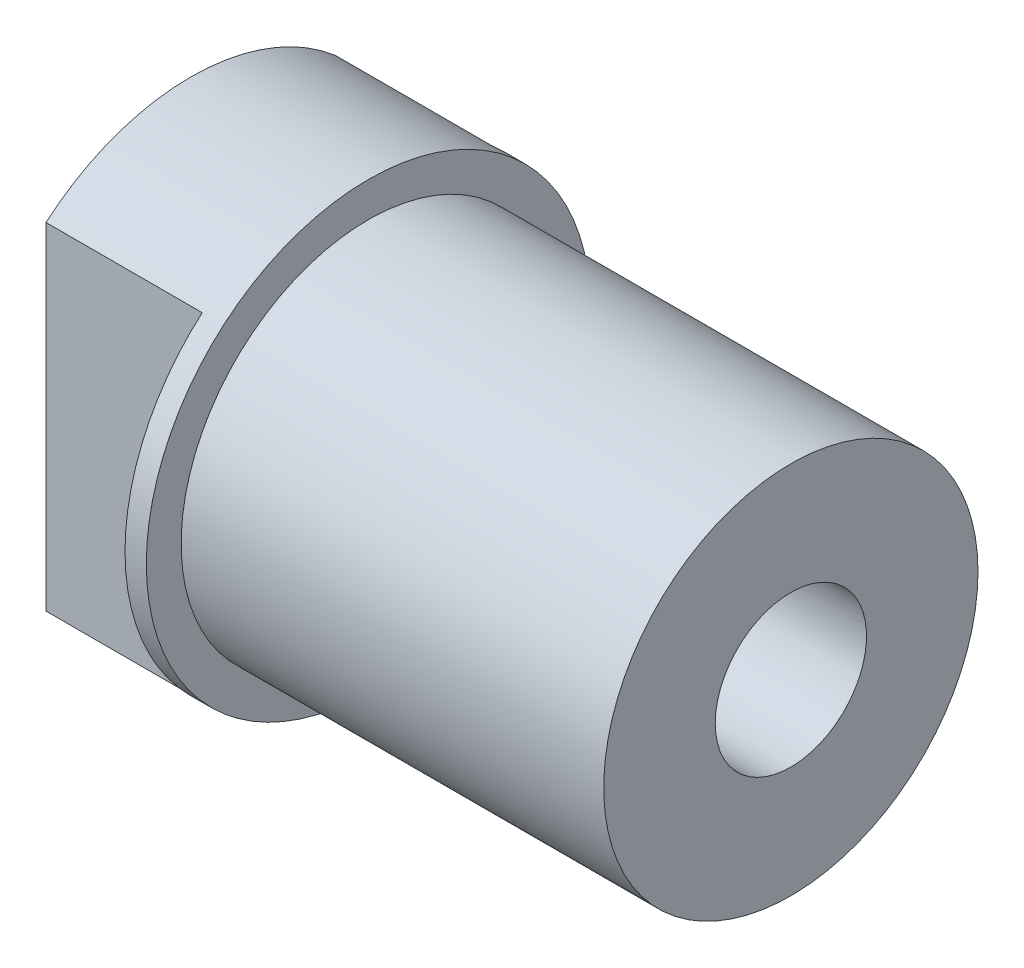
ISO-10303-21;
HEADER;
FILE_DESCRIPTION(('STEP AP214'),'2;1');
FILE_NAME('part.step','',(''),(''),'','','');
FILE_SCHEMA(('AUTOMOTIVE_DESIGN { 1 0 10303 214 1 1 1 1 }'));
ENDSEC;
DATA;
#1=APPLICATION_CONTEXT('core data for automotive mechanical design processes');
#2=APPLICATION_PROTOCOL_DEFINITION('international standard','automotive_design',2000,#1);
#3=PRODUCT_CONTEXT('',#1,'mechanical');
#4=PRODUCT('Part','Part','',(#3));
#5=PRODUCT_RELATED_PRODUCT_CATEGORY('part','',(#4));
#6=PRODUCT_DEFINITION_FORMATION('','',#4);
#7=PRODUCT_DEFINITION_CONTEXT('part definition',#1,'design');
#8=PRODUCT_DEFINITION('design','',#6,#7);
#9=PRODUCT_DEFINITION_SHAPE('','',#8);
#10=(LENGTH_UNIT() NAMED_UNIT(*) SI_UNIT(.MILLI.,.METRE.));
#11=(NAMED_UNIT(*) PLANE_ANGLE_UNIT() SI_UNIT($,.RADIAN.));
#12=(NAMED_UNIT(*) SI_UNIT($,.STERADIAN.) SOLID_ANGLE_UNIT());
#13=UNCERTAINTY_MEASURE_WITH_UNIT(LENGTH_MEASURE(1.E-05),#10,'distance_accuracy_value','');
#14=(GEOMETRIC_REPRESENTATION_CONTEXT(3) GLOBAL_UNCERTAINTY_ASSIGNED_CONTEXT((#13)) GLOBAL_UNIT_ASSIGNED_CONTEXT((#10,
#11,#12)) REPRESENTATION_CONTEXT('',''));
#15=CARTESIAN_POINT('',(0.,0.,0.));
#16=DIRECTION('',(0.,0.,1.));
#17=DIRECTION('',(1.,0.,0.));
#18=AXIS2_PLACEMENT_3D('',#15,#16,#17);
#19=CARTESIAN_POINT('',(-6.35,0.,0.));
#20=DIRECTION('',(1.,0.,0.));
#21=DIRECTION('',(0.,0.,-1.));
#22=AXIS2_PLACEMENT_3D('',#19,#20,#21);
#23=CYLINDRICAL_SURFACE('',#22,7.9375);
#24=DIRECTION('',(1.,0.,0.));
#25=VECTOR('',#24,1.);
#26=CARTESIAN_POINT('',(-6.35,-6.01836304052024,-5.17525));
#27=LINE('',#26,#25);
#28=CARTESIAN_POINT('',(-0.762,-6.01836304052024,-5.17525));
#29=VERTEX_POINT('',#28);
#30=CARTESIAN_POINT('',(-6.35,-6.01836304052024,-5.17525));
#31=VERTEX_POINT('',#30);
#32=EDGE_CURVE('E52',#29,#31,#27,.F.);
#33=ORIENTED_EDGE('',*,*,#32,.F.);
#34=CARTESIAN_POINT('',(-0.762,0.,0.));
#35=DIRECTION('',(1.,0.,0.));
#36=DIRECTION('',(0.,0.,-1.));
#37=AXIS2_PLACEMENT_3D('',#34,#35,#36);
#38=CIRCLE('',#37,7.9375);
#39=CARTESIAN_POINT('',(-0.762,6.01836304052024,-5.17525));
#40=VERTEX_POINT('',#39);
#41=EDGE_CURVE('E11',#40,#29,#38,.F.);
#42=ORIENTED_EDGE('',*,*,#41,.F.);
#43=DIRECTION('',(1.,0.,0.));
#44=VECTOR('',#43,1.);
#45=CARTESIAN_POINT('',(-6.35,6.01836304052024,-5.17525));
#46=LINE('',#45,#44);
#47=CARTESIAN_POINT('',(-6.35,6.01836304052024,-5.17525));
#48=VERTEX_POINT('',#47);
#49=EDGE_CURVE('E102',#48,#40,#46,.T.);
#50=ORIENTED_EDGE('',*,*,#49,.F.);
#51=CARTESIAN_POINT('',(-6.35,0.,0.));
#52=DIRECTION('',(1.,0.,0.));
#53=DIRECTION('',(0.,0.,-1.));
#54=AXIS2_PLACEMENT_3D('',#51,#52,#53);
#55=CIRCLE('',#54,7.9375);
#56=CARTESIAN_POINT('',(-6.35,6.01836304052024,5.17525));
#57=VERTEX_POINT('',#56);
#58=EDGE_CURVE('E112',#48,#57,#55,.T.);
#59=ORIENTED_EDGE('',*,*,#58,.T.);
#60=DIRECTION('',(1.,0.,0.));
#61=VECTOR('',#60,1.);
#62=CARTESIAN_POINT('',(-6.35,6.01836304052024,5.17525));
#63=LINE('',#62,#61);
#64=CARTESIAN_POINT('',(-0.762,6.01836304052024,5.17525));
#65=VERTEX_POINT('',#64);
#66=EDGE_CURVE('E60',#65,#57,#63,.F.);
#67=ORIENTED_EDGE('',*,*,#66,.F.);
#68=CARTESIAN_POINT('',(-0.762,0.,0.));
#69=DIRECTION('',(1.,0.,0.));
#70=DIRECTION('',(0.,0.,-1.));
#71=AXIS2_PLACEMENT_3D('',#68,#69,#70);
#72=CIRCLE('',#71,7.9375);
#73=CARTESIAN_POINT('',(-0.762,-6.01836304052024,5.17525));
#74=VERTEX_POINT('',#73);
#75=EDGE_CURVE('E45',#74,#65,#72,.F.);
#76=ORIENTED_EDGE('',*,*,#75,.F.);
#77=DIRECTION('',(1.,0.,0.));
#78=VECTOR('',#77,1.);
#79=CARTESIAN_POINT('',(-6.35,-6.01836304052024,5.17525));
#80=LINE('',#79,#78);
#81=CARTESIAN_POINT('',(-6.35,-6.01836304052024,5.17525));
#82=VERTEX_POINT('',#81);
#83=EDGE_CURVE('E81',#82,#74,#80,.T.);
#84=ORIENTED_EDGE('',*,*,#83,.F.);
#85=EDGE_CURVE('E113',#82,#31,#55,.T.);
#86=ORIENTED_EDGE('',*,*,#85,.T.);
#87=EDGE_LOOP('',(#33,#42,#50,#59,#67,#76,#84,#86));
#88=FACE_BOUND('',#87,.T.);
#89=CARTESIAN_POINT('',(0.,0.,0.));
#90=DIRECTION('',(1.,0.,0.));
#91=DIRECTION('',(0.,0.,-1.));
#92=AXIS2_PLACEMENT_3D('',#89,#90,#91);
#93=CIRCLE('',#92,7.9375);
#94=CARTESIAN_POINT('',(0.,0.,-7.9375));
#95=VERTEX_POINT('',#94);
#96=EDGE_CURVE('E108',#95,#95,#93,.T.);
#97=ORIENTED_EDGE('',*,*,#96,.F.);
#98=EDGE_LOOP('',(#97));
#99=FACE_BOUND('',#98,.T.);
#100=ADVANCED_FACE('F38',(#88,#99),#23,.T.);
#101=CARTESIAN_POINT('',(-6.35,0.,0.));
#102=DIRECTION('',(1.,0.,0.));
#103=DIRECTION('',(0.,0.,-1.));
#104=AXIS2_PLACEMENT_3D('',#101,#102,#103);
#105=PLANE('',#104);
#106=CARTESIAN_POINT('',(-6.35,0.,0.));
#107=DIRECTION('',(-1.,0.,0.));
#108=DIRECTION('',(0.,0.,1.));
#109=AXIS2_PLACEMENT_3D('',#106,#107,#108);
#110=CIRCLE('',#109,2.7051);
#111=CARTESIAN_POINT('',(-6.35,0.,2.7051));
#112=VERTEX_POINT('',#111);
#113=EDGE_CURVE('E98',#112,#112,#110,.T.);
#114=ORIENTED_EDGE('',*,*,#113,.F.);
#115=EDGE_LOOP('',(#114));
#116=FACE_BOUND('',#115,.T.);
#117=ORIENTED_EDGE('',*,*,#58,.F.);
#118=DIRECTION('',(0.,-1.,0.));
#119=VECTOR('',#118,1.);
#120=CARTESIAN_POINT('',(-6.35,0.,-5.17525));
#121=LINE('',#120,#119);
#122=EDGE_CURVE('E86',#48,#31,#121,.T.);
#123=ORIENTED_EDGE('',*,*,#122,.T.);
#124=ORIENTED_EDGE('',*,*,#85,.F.);
#125=DIRECTION('',(0.,1.,0.));
#126=VECTOR('',#125,1.);
#127=CARTESIAN_POINT('',(-6.35,0.,5.17525));
#128=LINE('',#127,#126);
#129=EDGE_CURVE('E89',#82,#57,#128,.T.);
#130=ORIENTED_EDGE('',*,*,#129,.T.);
#131=EDGE_LOOP('',(#117,#123,#124,#130));
#132=FACE_BOUND('',#131,.T.);
#133=ADVANCED_FACE('F120',(#116,#132),#105,.F.);
#134=CARTESIAN_POINT('',(0.,0.,0.));
#135=DIRECTION('',(1.,0.,0.));
#136=DIRECTION('',(0.,0.,-1.));
#137=AXIS2_PLACEMENT_3D('',#134,#135,#136);
#138=PLANE('',#137);
#139=CARTESIAN_POINT('',(0.,0.,0.));
#140=DIRECTION('',(1.,0.,0.));
#141=DIRECTION('',(0.,0.,-1.));
#142=AXIS2_PLACEMENT_3D('',#139,#140,#141);
#143=CIRCLE('',#142,6.6929);
#144=CARTESIAN_POINT('',(0.,0.,-6.6929));
#145=VERTEX_POINT('',#144);
#146=EDGE_CURVE('E109',#145,#145,#143,.T.);
#147=ORIENTED_EDGE('',*,*,#146,.F.);
#148=EDGE_LOOP('',(#147));
#149=FACE_BOUND('',#148,.T.);
#150=ORIENTED_EDGE('',*,*,#96,.T.);
#151=EDGE_LOOP('',(#150));
#152=FACE_BOUND('',#151,.T.);
#153=ADVANCED_FACE('F141',(#149,#152),#138,.T.);
#154=CARTESIAN_POINT('',(15.113,0.,0.));
#155=DIRECTION('',(-1.,0.,0.));
#156=DIRECTION('',(0.,0.,1.));
#157=AXIS2_PLACEMENT_3D('',#154,#155,#156);
#158=CYLINDRICAL_SURFACE('',#157,6.6929);
#159=CARTESIAN_POINT('',(15.113,0.,0.));
#160=DIRECTION('',(1.,0.,0.));
#161=DIRECTION('',(0.,0.,-1.));
#162=AXIS2_PLACEMENT_3D('',#159,#160,#161);
#163=CIRCLE('',#162,6.6929);
#164=CARTESIAN_POINT('',(15.113,0.,-6.6929));
#165=VERTEX_POINT('',#164);
#166=EDGE_CURVE('E105',#165,#165,#163,.T.);
#167=ORIENTED_EDGE('',*,*,#166,.F.);
#168=EDGE_LOOP('',(#167));
#169=FACE_BOUND('',#168,.T.);
#170=ORIENTED_EDGE('',*,*,#146,.T.);
#171=EDGE_LOOP('',(#170));
#172=FACE_BOUND('',#171,.T.);
#173=ADVANCED_FACE('F147',(#169,#172),#158,.T.);
#174=CARTESIAN_POINT('',(15.113,0.,0.));
#175=DIRECTION('',(1.,0.,0.));
#176=DIRECTION('',(0.,0.,-1.));
#177=AXIS2_PLACEMENT_3D('',#174,#175,#176);
#178=PLANE('',#177);
#179=CARTESIAN_POINT('',(15.113,0.,0.));
#180=DIRECTION('',(-1.,0.,0.));
#181=DIRECTION('',(0.,0.,1.));
#182=AXIS2_PLACEMENT_3D('',#179,#180,#181);
#183=CIRCLE('',#182,2.70509999999999);
#184=CARTESIAN_POINT('',(15.113,0.,2.70509999999999));
#185=VERTEX_POINT('',#184);
#186=EDGE_CURVE('E93',#185,#185,#183,.T.);
#187=ORIENTED_EDGE('',*,*,#186,.T.);
#188=EDGE_LOOP('',(#187));
#189=FACE_BOUND('',#188,.T.);
#190=ORIENTED_EDGE('',*,*,#166,.T.);
#191=EDGE_LOOP('',(#190));
#192=FACE_BOUND('',#191,.T.);
#193=ADVANCED_FACE('F153',(#189,#192),#178,.T.);
#194=CARTESIAN_POINT('',(-6.35,-6.35,5.17525));
#195=DIRECTION('',(0.,0.,-1.));
#196=DIRECTION('',(-1.,0.,0.));
#197=AXIS2_PLACEMENT_3D('',#194,#195,#196);
#198=PLANE('',#197);
#199=ORIENTED_EDGE('',*,*,#66,.T.);
#200=ORIENTED_EDGE('',*,*,#129,.F.);
#201=ORIENTED_EDGE('',*,*,#83,.T.);
#202=DIRECTION('',(0.,1.,0.));
#203=VECTOR('',#202,1.);
#204=CARTESIAN_POINT('',(-0.762,-6.35,5.17525));
#205=LINE('',#204,#203);
#206=EDGE_CURVE('E88',#74,#65,#205,.T.);
#207=ORIENTED_EDGE('',*,*,#206,.T.);
#208=EDGE_LOOP('',(#199,#200,#201,#207));
#209=FACE_BOUND('',#208,.T.);
#210=ADVANCED_FACE('F87',(#209),#198,.F.);
#211=CARTESIAN_POINT('',(-0.762,-6.35,7.9375));
#212=DIRECTION('',(1.,0.,0.));
#213=DIRECTION('',(0.,0.,-1.));
#214=AXIS2_PLACEMENT_3D('',#211,#212,#213);
#215=PLANE('',#214);
#216=ORIENTED_EDGE('',*,*,#206,.F.);
#217=ORIENTED_EDGE('',*,*,#75,.T.);
#218=EDGE_LOOP('',(#216,#217));
#219=FACE_BOUND('',#218,.T.);
#220=ADVANCED_FACE('F92',(#219),#215,.F.);
#221=CARTESIAN_POINT('',(-0.762,-6.35,-7.9375));
#222=DIRECTION('',(1.,0.,0.));
#223=DIRECTION('',(0.,0.,-1.));
#224=AXIS2_PLACEMENT_3D('',#221,#222,#223);
#225=PLANE('',#224);
#226=ORIENTED_EDGE('',*,*,#41,.T.);
#227=DIRECTION('',(0.,1.,0.));
#228=VECTOR('',#227,1.);
#229=CARTESIAN_POINT('',(-0.762,-6.35,-5.17525));
#230=LINE('',#229,#228);
#231=EDGE_CURVE('E90',#29,#40,#230,.T.);
#232=ORIENTED_EDGE('',*,*,#231,.T.);
#233=EDGE_LOOP('',(#226,#232));
#234=FACE_BOUND('',#233,.T.);
#235=ADVANCED_FACE('F124',(#234),#225,.F.);
#236=CARTESIAN_POINT('',(-6.35,-6.35,-5.17525));
#237=DIRECTION('',(0.,0.,1.));
#238=DIRECTION('',(1.,0.,0.));
#239=AXIS2_PLACEMENT_3D('',#236,#237,#238);
#240=PLANE('',#239);
#241=ORIENTED_EDGE('',*,*,#32,.T.);
#242=ORIENTED_EDGE('',*,*,#122,.F.);
#243=ORIENTED_EDGE('',*,*,#49,.T.);
#244=ORIENTED_EDGE('',*,*,#231,.F.);
#245=EDGE_LOOP('',(#241,#242,#243,#244));
#246=FACE_BOUND('',#245,.T.);
#247=ADVANCED_FACE('F125',(#246),#240,.F.);
#248=CARTESIAN_POINT('',(-6.35,0.,0.));
#249=DIRECTION('',(-1.,0.,0.));
#250=DIRECTION('',(0.,0.,1.));
#251=AXIS2_PLACEMENT_3D('',#248,#249,#250);
#252=CYLINDRICAL_SURFACE('',#251,2.7051);
#253=ORIENTED_EDGE('',*,*,#186,.F.);
#254=EDGE_LOOP('',(#253));
#255=FACE_BOUND('',#254,.T.);
#256=ORIENTED_EDGE('',*,*,#113,.T.);
#257=EDGE_LOOP('',(#256));
#258=FACE_BOUND('',#257,.T.);
#259=ADVANCED_FACE('F127',(#255,#258),#252,.F.);
#260=CLOSED_SHELL('',(#100,#133,#153,#173,#193,#210,#220,#235,#247,#259));
#261=MANIFOLD_SOLID_BREP('B2',#260);
#262=ADVANCED_BREP_SHAPE_REPRESENTATION('',(#18,#261),#14);
#263=SHAPE_DEFINITION_REPRESENTATION(#9,#262);
ENDSEC;
END-ISO-10303-21;
